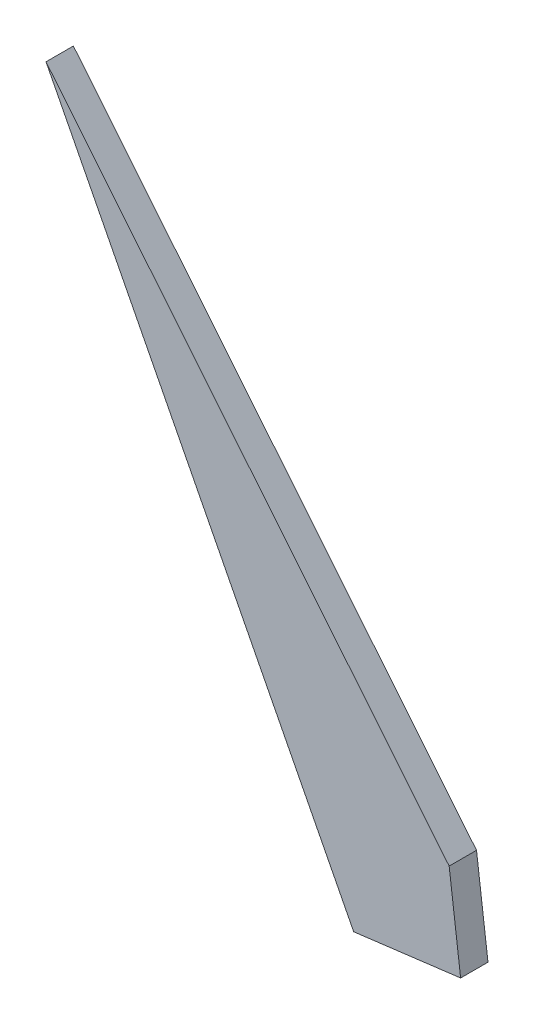
ISO-10303-21;
HEADER;
FILE_DESCRIPTION(('STEP AP214'),'2;1');
FILE_NAME('part.step','',(''),(''),'','','');
FILE_SCHEMA(('AUTOMOTIVE_DESIGN { 1 0 10303 214 1 1 1 1 }'));
ENDSEC;
DATA;
#1=APPLICATION_CONTEXT('core data for automotive mechanical design processes');
#2=APPLICATION_PROTOCOL_DEFINITION('international standard','automotive_design',2000,#1);
#3=PRODUCT_CONTEXT('',#1,'mechanical');
#4=PRODUCT('Part','Part','',(#3));
#5=PRODUCT_RELATED_PRODUCT_CATEGORY('part','',(#4));
#6=PRODUCT_DEFINITION_FORMATION('','',#4);
#7=PRODUCT_DEFINITION_CONTEXT('part definition',#1,'design');
#8=PRODUCT_DEFINITION('design','',#6,#7);
#9=PRODUCT_DEFINITION_SHAPE('','',#8);
#10=(LENGTH_UNIT() NAMED_UNIT(*) SI_UNIT(.MILLI.,.METRE.));
#11=(NAMED_UNIT(*) PLANE_ANGLE_UNIT() SI_UNIT($,.RADIAN.));
#12=(NAMED_UNIT(*) SI_UNIT($,.STERADIAN.) SOLID_ANGLE_UNIT());
#13=UNCERTAINTY_MEASURE_WITH_UNIT(LENGTH_MEASURE(1.E-05),#10,'distance_accuracy_value','');
#14=(GEOMETRIC_REPRESENTATION_CONTEXT(3) GLOBAL_UNCERTAINTY_ASSIGNED_CONTEXT((#13)) GLOBAL_UNIT_ASSIGNED_CONTEXT((#10,
#11,#12)) REPRESENTATION_CONTEXT('',''));
#15=CARTESIAN_POINT('',(0.,0.,0.));
#16=DIRECTION('',(0.,0.,1.));
#17=DIRECTION('',(1.,0.,0.));
#18=AXIS2_PLACEMENT_3D('',#15,#16,#17);
#19=CARTESIAN_POINT('',(-2.86929473980156,-1.22766198215652,3.));
#20=DIRECTION('',(-0.992192735918911,-0.124713971910708,0.));
#21=DIRECTION('',(0.124713971910708,-0.992192735918912,0.));
#22=AXIS2_PLACEMENT_3D('',#19,#20,#21);
#23=PLANE('',#22);
#24=DIRECTION('',(-0.124713971910708,0.992192735918912,0.));
#25=VECTOR('',#24,1.);
#26=CARTESIAN_POINT('',(-2.86929473980156,-1.22766198215652,0.));
#27=LINE('',#26,#25);
#28=CARTESIAN_POINT('',(-1.61234165603195,-11.2276619821565,0.));
#29=VERTEX_POINT('',#28);
#30=CARTESIAN_POINT('',(-2.86929473980156,-1.22766198215652,0.));
#31=VERTEX_POINT('',#30);
#32=EDGE_CURVE('E96',#29,#31,#27,.T.);
#33=ORIENTED_EDGE('',*,*,#32,.T.);
#34=DIRECTION('',(0.,0.,-1.));
#35=VECTOR('',#34,1.);
#36=CARTESIAN_POINT('',(-2.86929473980156,-1.22766198215652,3.));
#37=LINE('',#36,#35);
#38=CARTESIAN_POINT('',(-2.86929473980156,-1.22766198215652,3.));
#39=VERTEX_POINT('',#38);
#40=EDGE_CURVE('E11',#39,#31,#37,.T.);
#41=ORIENTED_EDGE('',*,*,#40,.F.);
#42=DIRECTION('',(-0.124713971910708,0.992192735918912,0.));
#43=VECTOR('',#42,1.);
#44=CARTESIAN_POINT('',(-2.86929473980156,-1.22766198215652,3.));
#45=LINE('',#44,#43);
#46=CARTESIAN_POINT('',(-1.61234165603195,-11.2276619821565,3.));
#47=VERTEX_POINT('',#46);
#48=EDGE_CURVE('E84',#47,#39,#45,.T.);
#49=ORIENTED_EDGE('',*,*,#48,.F.);
#50=DIRECTION('',(0.,0.,-1.));
#51=VECTOR('',#50,1.);
#52=CARTESIAN_POINT('',(-1.61234165603195,-11.2276619821565,3.));
#53=LINE('',#52,#51);
#54=EDGE_CURVE('E92',#47,#29,#53,.T.);
#55=ORIENTED_EDGE('',*,*,#54,.T.);
#56=EDGE_LOOP('',(#33,#41,#49,#55));
#57=FACE_BOUND('',#56,.T.);
#58=ADVANCED_FACE('F33',(#57),#23,.F.);
#59=CARTESIAN_POINT('',(-2.86929473980156,-1.22766198215652,3.));
#60=DIRECTION('',(-0.775338824481745,-0.631545491038663,0.));
#61=DIRECTION('',(0.631545491038663,-0.775338824481745,0.));
#62=AXIS2_PLACEMENT_3D('',#59,#60,#61);
#63=PLANE('',#62);
#64=DIRECTION('',(-0.631545491038663,0.775338824481745,0.));
#65=VECTOR('',#64,1.);
#66=CARTESIAN_POINT('',(-2.86929473980156,-1.22766198215652,0.));
#67=LINE('',#66,#65);
#68=CARTESIAN_POINT('',(-47.077479112508,53.0460557315656,0.));
#69=VERTEX_POINT('',#68);
#70=EDGE_CURVE('E88',#31,#69,#67,.T.);
#71=ORIENTED_EDGE('',*,*,#70,.T.);
#72=DIRECTION('',(0.,0.,-1.));
#73=VECTOR('',#72,1.);
#74=CARTESIAN_POINT('',(-47.077479112508,53.0460557315656,3.));
#75=LINE('',#74,#73);
#76=CARTESIAN_POINT('',(-47.077479112508,53.0460557315656,3.));
#77=VERTEX_POINT('',#76);
#78=EDGE_CURVE('E41',#77,#69,#75,.T.);
#79=ORIENTED_EDGE('',*,*,#78,.F.);
#80=DIRECTION('',(-0.631545491038663,0.775338824481745,0.));
#81=VECTOR('',#80,1.);
#82=CARTESIAN_POINT('',(-2.86929473980156,-1.22766198215652,3.));
#83=LINE('',#82,#81);
#84=EDGE_CURVE('E79',#39,#77,#83,.T.);
#85=ORIENTED_EDGE('',*,*,#84,.F.);
#86=ORIENTED_EDGE('',*,*,#40,.T.);
#87=EDGE_LOOP('',(#71,#79,#85,#86));
#88=FACE_BOUND('',#87,.T.);
#89=ADVANCED_FACE('F87',(#88),#63,.F.);
#90=CARTESIAN_POINT('',(-47.077479112508,53.0460557315656,3.));
#91=DIRECTION('',(0.889701501792767,0.456542700859071,0.));
#92=DIRECTION('',(-0.456542700859071,0.889701501792767,0.));
#93=AXIS2_PLACEMENT_3D('',#90,#91,#92);
#94=PLANE('',#93);
#95=DIRECTION('',(0.456542700859071,-0.889701501792767,0.));
#96=VECTOR('',#95,1.);
#97=CARTESIAN_POINT('',(-47.077479112508,53.0460557315656,0.));
#98=LINE('',#97,#96);
#99=CARTESIAN_POINT('',(-13.3395715787981,-12.7017197637061,0.));
#100=VERTEX_POINT('',#99);
#101=EDGE_CURVE('E66',#69,#100,#98,.T.);
#102=ORIENTED_EDGE('',*,*,#101,.T.);
#103=DIRECTION('',(0.,0.,-1.));
#104=VECTOR('',#103,1.);
#105=CARTESIAN_POINT('',(-13.3395715787981,-12.7017197637061,3.));
#106=LINE('',#105,#104);
#107=CARTESIAN_POINT('',(-13.3395715787981,-12.7017197637061,3.));
#108=VERTEX_POINT('',#107);
#109=EDGE_CURVE('E89',#108,#100,#106,.T.);
#110=ORIENTED_EDGE('',*,*,#109,.F.);
#111=DIRECTION('',(0.456542700859071,-0.889701501792767,0.));
#112=VECTOR('',#111,1.);
#113=CARTESIAN_POINT('',(-47.077479112508,53.0460557315656,3.));
#114=LINE('',#113,#112);
#115=EDGE_CURVE('E82',#77,#108,#114,.T.);
#116=ORIENTED_EDGE('',*,*,#115,.F.);
#117=ORIENTED_EDGE('',*,*,#78,.T.);
#118=EDGE_LOOP('',(#102,#110,#116,#117));
#119=FACE_BOUND('',#118,.T.);
#120=ADVANCED_FACE('F90',(#119),#94,.F.);
#121=CARTESIAN_POINT('',(-1.61234165603195,-11.2276619821565,3.));
#122=DIRECTION('',(-0.12471397191071,0.992192735918911,0.));
#123=DIRECTION('',(-0.992192735918912,-0.12471397191071,0.));
#124=AXIS2_PLACEMENT_3D('',#121,#122,#123);
#125=PLANE('',#124);
#126=DIRECTION('',(0.992192735918911,0.12471397191071,0.));
#127=VECTOR('',#126,1.);
#128=CARTESIAN_POINT('',(-1.61234165603195,-11.2276619821565,0.));
#129=LINE('',#128,#127);
#130=EDGE_CURVE('E72',#100,#29,#129,.T.);
#131=ORIENTED_EDGE('',*,*,#130,.T.);
#132=ORIENTED_EDGE('',*,*,#54,.F.);
#133=DIRECTION('',(0.992192735918911,0.12471397191071,0.));
#134=VECTOR('',#133,1.);
#135=CARTESIAN_POINT('',(-1.61234165603195,-11.2276619821565,3.));
#136=LINE('',#135,#134);
#137=EDGE_CURVE('E49',#108,#47,#136,.T.);
#138=ORIENTED_EDGE('',*,*,#137,.F.);
#139=ORIENTED_EDGE('',*,*,#109,.T.);
#140=EDGE_LOOP('',(#131,#132,#138,#139));
#141=FACE_BOUND('',#140,.T.);
#142=ADVANCED_FACE('F103',(#141),#125,.F.);
#143=CARTESIAN_POINT('',(0.,0.,3.));
#144=DIRECTION('',(0.,0.,-1.));
#145=DIRECTION('',(-1.,0.,0.));
#146=AXIS2_PLACEMENT_3D('',#143,#144,#145);
#147=PLANE('',#146);
#148=ORIENTED_EDGE('',*,*,#48,.T.);
#149=ORIENTED_EDGE('',*,*,#84,.T.);
#150=ORIENTED_EDGE('',*,*,#115,.T.);
#151=ORIENTED_EDGE('',*,*,#137,.T.);
#152=EDGE_LOOP('',(#148,#149,#150,#151));
#153=FACE_BOUND('',#152,.T.);
#154=ADVANCED_FACE('F80',(#153),#147,.F.);
#155=CARTESIAN_POINT('',(0.,0.,0.));
#156=DIRECTION('',(0.,0.,-1.));
#157=DIRECTION('',(-1.,0.,0.));
#158=AXIS2_PLACEMENT_3D('',#155,#156,#157);
#159=PLANE('',#158);
#160=ORIENTED_EDGE('',*,*,#32,.F.);
#161=ORIENTED_EDGE('',*,*,#130,.F.);
#162=ORIENTED_EDGE('',*,*,#101,.F.);
#163=ORIENTED_EDGE('',*,*,#70,.F.);
#164=EDGE_LOOP('',(#160,#161,#162,#163));
#165=FACE_BOUND('',#164,.T.);
#166=ADVANCED_FACE('F106',(#165),#159,.T.);
#167=CLOSED_SHELL('',(#58,#89,#120,#142,#154,#166));
#168=MANIFOLD_SOLID_BREP('B2',#167);
#169=ADVANCED_BREP_SHAPE_REPRESENTATION('',(#18,#168),#14);
#170=SHAPE_DEFINITION_REPRESENTATION(#9,#169);
ENDSEC;
END-ISO-10303-21;
